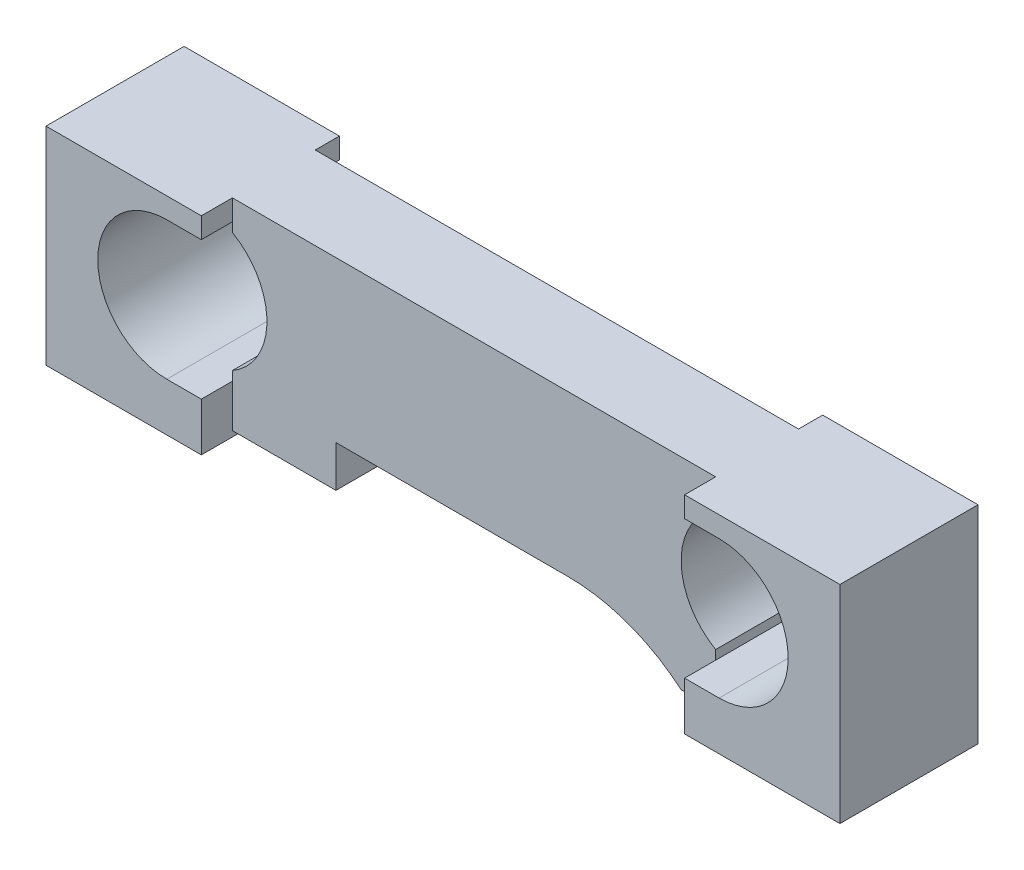
ISO-10303-21;
HEADER;
FILE_DESCRIPTION(('STEP AP214'),'2;1');
FILE_NAME('part.step','',(''),(''),'','','');
FILE_SCHEMA(('AUTOMOTIVE_DESIGN { 1 0 10303 214 1 1 1 1 }'));
ENDSEC;
DATA;
#1=APPLICATION_CONTEXT('core data for automotive mechanical design processes');
#2=APPLICATION_PROTOCOL_DEFINITION('international standard','automotive_design',2000,#1);
#3=PRODUCT_CONTEXT('',#1,'mechanical');
#4=PRODUCT('Part','Part','',(#3));
#5=PRODUCT_RELATED_PRODUCT_CATEGORY('part','',(#4));
#6=PRODUCT_DEFINITION_FORMATION('','',#4);
#7=PRODUCT_DEFINITION_CONTEXT('part definition',#1,'design');
#8=PRODUCT_DEFINITION('design','',#6,#7);
#9=PRODUCT_DEFINITION_SHAPE('','',#8);
#10=(LENGTH_UNIT() NAMED_UNIT(*) SI_UNIT(.MILLI.,.METRE.));
#11=(NAMED_UNIT(*) PLANE_ANGLE_UNIT() SI_UNIT($,.RADIAN.));
#12=(NAMED_UNIT(*) SI_UNIT($,.STERADIAN.) SOLID_ANGLE_UNIT());
#13=UNCERTAINTY_MEASURE_WITH_UNIT(LENGTH_MEASURE(1.E-05),#10,'distance_accuracy_value','');
#14=(GEOMETRIC_REPRESENTATION_CONTEXT(3) GLOBAL_UNCERTAINTY_ASSIGNED_CONTEXT((#13)) GLOBAL_UNIT_ASSIGNED_CONTEXT((#10,
#11,#12)) REPRESENTATION_CONTEXT('',''));
#15=CARTESIAN_POINT('',(0.,0.,0.));
#16=DIRECTION('',(0.,0.,1.));
#17=DIRECTION('',(1.,0.,0.));
#18=AXIS2_PLACEMENT_3D('',#15,#16,#17);
#19=CARTESIAN_POINT('',(234.95,76.2,0.));
#20=DIRECTION('',(1.,0.,0.));
#21=DIRECTION('',(0.,0.,-1.));
#22=AXIS2_PLACEMENT_3D('',#19,#20,#21);
#23=PLANE('',#22);
#24=DIRECTION('',(0.,-1.,0.));
#25=VECTOR('',#24,1.);
#26=CARTESIAN_POINT('',(234.95,76.2,0.));
#27=LINE('',#26,#25);
#28=CARTESIAN_POINT('',(234.95,17.78,0.));
#29=VERTEX_POINT('',#28);
#30=CARTESIAN_POINT('',(234.95,0.,0.));
#31=VERTEX_POINT('',#30);
#32=EDGE_CURVE('E428',#29,#31,#27,.T.);
#33=ORIENTED_EDGE('',*,*,#32,.F.);
#34=DIRECTION('',(0.,0.,1.));
#35=VECTOR('',#34,1.);
#36=CARTESIAN_POINT('',(234.95,17.78,-50.8));
#37=LINE('',#36,#35);
#38=CARTESIAN_POINT('',(234.95,17.78,-11.43));
#39=VERTEX_POINT('',#38);
#40=EDGE_CURVE('E276',#39,#29,#37,.T.);
#41=ORIENTED_EDGE('',*,*,#40,.F.);
#42=DIRECTION('',(0.,-1.,0.));
#43=VECTOR('',#42,1.);
#44=CARTESIAN_POINT('',(234.95,76.2,-11.43));
#45=LINE('',#44,#43);
#46=CARTESIAN_POINT('',(234.95,2.03200000000001,-11.43));
#47=VERTEX_POINT('',#46);
#48=EDGE_CURVE('E432',#39,#47,#45,.T.);
#49=ORIENTED_EDGE('',*,*,#48,.T.);
#50=DIRECTION('',(0.,0.,1.));
#51=VECTOR('',#50,1.);
#52=CARTESIAN_POINT('',(234.95,2.032,-11.43));
#53=LINE('',#52,#51);
#54=CARTESIAN_POINT('',(234.95,2.03200000000001,-41.91));
#55=VERTEX_POINT('',#54);
#56=EDGE_CURVE('E349',#55,#47,#53,.T.);
#57=ORIENTED_EDGE('',*,*,#56,.F.);
#58=DIRECTION('',(0.,-1.,0.));
#59=VECTOR('',#58,1.);
#60=CARTESIAN_POINT('',(234.95,76.2,-41.91));
#61=LINE('',#60,#59);
#62=CARTESIAN_POINT('',(234.95,17.78,-41.91));
#63=VERTEX_POINT('',#62);
#64=EDGE_CURVE('E398',#63,#55,#61,.T.);
#65=ORIENTED_EDGE('',*,*,#64,.F.);
#66=CARTESIAN_POINT('',(234.95,17.78,-50.8));
#67=VERTEX_POINT('',#66);
#68=EDGE_CURVE('E272',#67,#63,#37,.T.);
#69=ORIENTED_EDGE('',*,*,#68,.F.);
#70=DIRECTION('',(0.,-1.,0.));
#71=VECTOR('',#70,1.);
#72=CARTESIAN_POINT('',(234.95,76.2,-50.8));
#73=LINE('',#72,#71);
#74=CARTESIAN_POINT('',(234.95,0.,-50.8));
#75=VERTEX_POINT('',#74);
#76=EDGE_CURVE('E401',#67,#75,#73,.T.);
#77=ORIENTED_EDGE('',*,*,#76,.T.);
#78=DIRECTION('',(0.,0.,1.));
#79=VECTOR('',#78,1.);
#80=CARTESIAN_POINT('',(234.95,0.,0.));
#81=LINE('',#80,#79);
#82=EDGE_CURVE('E409',#75,#31,#81,.T.);
#83=ORIENTED_EDGE('',*,*,#82,.T.);
#84=EDGE_LOOP('',(#33,#41,#49,#57,#65,#69,#77,#83));
#85=FACE_BOUND('',#84,.T.);
#86=ADVANCED_FACE('F34',(#85),#23,.F.);
#87=CARTESIAN_POINT('',(234.95,76.2,-50.8));
#88=VERTEX_POINT('',#87);
#89=CARTESIAN_POINT('',(234.95,68.58,-50.8));
#90=VERTEX_POINT('',#89);
#91=EDGE_CURVE('E399',#88,#90,#73,.T.);
#92=ORIENTED_EDGE('',*,*,#91,.T.);
#93=DIRECTION('',(0.,0.,1.));
#94=VECTOR('',#93,1.);
#95=CARTESIAN_POINT('',(234.95,68.58,-50.8));
#96=LINE('',#95,#94);
#97=CARTESIAN_POINT('',(234.95,68.58,-41.91));
#98=VERTEX_POINT('',#97);
#99=EDGE_CURVE('E57',#90,#98,#96,.T.);
#100=ORIENTED_EDGE('',*,*,#99,.T.);
#101=CARTESIAN_POINT('',(234.95,76.2,-41.91));
#102=VERTEX_POINT('',#101);
#103=EDGE_CURVE('E395',#102,#98,#61,.T.);
#104=ORIENTED_EDGE('',*,*,#103,.F.);
#105=DIRECTION('',(0.,0.,1.));
#106=VECTOR('',#105,1.);
#107=CARTESIAN_POINT('',(234.95,76.2,-50.8));
#108=LINE('',#107,#106);
#109=EDGE_CURVE('E382',#88,#102,#108,.T.);
#110=ORIENTED_EDGE('',*,*,#109,.F.);
#111=EDGE_LOOP('',(#92,#100,#104,#110));
#112=FACE_BOUND('',#111,.T.);
#113=ADVANCED_FACE('F560',(#112),#23,.F.);
#114=CARTESIAN_POINT('',(57.15,76.2,0.));
#115=DIRECTION('',(-1.,0.,0.));
#116=DIRECTION('',(0.,0.,1.));
#117=AXIS2_PLACEMENT_3D('',#114,#115,#116);
#118=PLANE('',#117);
#119=DIRECTION('',(0.,-1.,0.));
#120=VECTOR('',#119,1.);
#121=CARTESIAN_POINT('',(57.15,76.2,-41.91));
#122=LINE('',#121,#120);
#123=CARTESIAN_POINT('',(57.15,76.2,-41.91));
#124=VERTEX_POINT('',#123);
#125=CARTESIAN_POINT('',(57.15,68.58,-41.91));
#126=VERTEX_POINT('',#125);
#127=EDGE_CURVE('E389',#124,#126,#122,.T.);
#128=ORIENTED_EDGE('',*,*,#127,.T.);
#129=DIRECTION('',(0.,0.,1.));
#130=VECTOR('',#129,1.);
#131=CARTESIAN_POINT('',(57.15,68.58,-50.8));
#132=LINE('',#131,#130);
#133=CARTESIAN_POINT('',(57.15,68.58,-50.8));
#134=VERTEX_POINT('',#133);
#135=EDGE_CURVE('E323',#134,#126,#132,.T.);
#136=ORIENTED_EDGE('',*,*,#135,.F.);
#137=DIRECTION('',(0.,-1.,0.));
#138=VECTOR('',#137,1.);
#139=CARTESIAN_POINT('',(57.15,76.2,-50.8));
#140=LINE('',#139,#138);
#141=CARTESIAN_POINT('',(57.15,76.2,-50.8));
#142=VERTEX_POINT('',#141);
#143=EDGE_CURVE('E402',#142,#134,#140,.T.);
#144=ORIENTED_EDGE('',*,*,#143,.F.);
#145=DIRECTION('',(0.,0.,-1.));
#146=VECTOR('',#145,1.);
#147=CARTESIAN_POINT('',(57.15,76.2,-50.8));
#148=LINE('',#147,#146);
#149=EDGE_CURVE('E379',#124,#142,#148,.T.);
#150=ORIENTED_EDGE('',*,*,#149,.F.);
#151=EDGE_LOOP('',(#128,#136,#144,#150));
#152=FACE_BOUND('',#151,.T.);
#153=ADVANCED_FACE('F600',(#152),#118,.F.);
#154=DIRECTION('',(0.,-1.,0.));
#155=VECTOR('',#154,1.);
#156=CARTESIAN_POINT('',(57.15,76.2,0.));
#157=LINE('',#156,#155);
#158=CARTESIAN_POINT('',(57.15,76.2,0.));
#159=VERTEX_POINT('',#158);
#160=CARTESIAN_POINT('',(57.15,68.58,0.));
#161=VERTEX_POINT('',#160);
#162=EDGE_CURVE('E420',#159,#161,#157,.T.);
#163=ORIENTED_EDGE('',*,*,#162,.T.);
#164=DIRECTION('',(0.,0.,-1.));
#165=VECTOR('',#164,1.);
#166=CARTESIAN_POINT('',(57.15,68.58,0.));
#167=LINE('',#166,#165);
#168=CARTESIAN_POINT('',(57.15,68.58,-11.43));
#169=VERTEX_POINT('',#168);
#170=EDGE_CURVE('E11',#161,#169,#167,.T.);
#171=ORIENTED_EDGE('',*,*,#170,.T.);
#172=DIRECTION('',(0.,-1.,0.));
#173=VECTOR('',#172,1.);
#174=CARTESIAN_POINT('',(57.15,76.2,-11.43));
#175=LINE('',#174,#173);
#176=CARTESIAN_POINT('',(57.15,76.2,-11.43));
#177=VERTEX_POINT('',#176);
#178=EDGE_CURVE('E433',#177,#169,#175,.T.);
#179=ORIENTED_EDGE('',*,*,#178,.F.);
#180=DIRECTION('',(0.,0.,-1.));
#181=VECTOR('',#180,1.);
#182=CARTESIAN_POINT('',(57.15,76.2,0.));
#183=LINE('',#182,#181);
#184=EDGE_CURVE('E405',#159,#177,#183,.T.);
#185=ORIENTED_EDGE('',*,*,#184,.F.);
#186=EDGE_LOOP('',(#163,#171,#179,#185));
#187=FACE_BOUND('',#186,.T.);
#188=ADVANCED_FACE('F585',(#187),#118,.F.);
#189=CARTESIAN_POINT('',(234.95,76.2,-11.43));
#190=VERTEX_POINT('',#189);
#191=CARTESIAN_POINT('',(234.95,68.58,-11.43));
#192=VERTEX_POINT('',#191);
#193=EDGE_CURVE('E429',#190,#192,#45,.T.);
#194=ORIENTED_EDGE('',*,*,#193,.T.);
#195=CARTESIAN_POINT('',(234.95,68.58,0.));
#196=VERTEX_POINT('',#195);
#197=EDGE_CURVE('E249',#192,#196,#96,.T.);
#198=ORIENTED_EDGE('',*,*,#197,.T.);
#199=CARTESIAN_POINT('',(234.95,76.2,0.));
#200=VERTEX_POINT('',#199);
#201=EDGE_CURVE('E425',#200,#196,#27,.T.);
#202=ORIENTED_EDGE('',*,*,#201,.F.);
#203=DIRECTION('',(0.,0.,1.));
#204=VECTOR('',#203,1.);
#205=CARTESIAN_POINT('',(234.95,76.2,0.));
#206=LINE('',#205,#204);
#207=EDGE_CURVE('E412',#190,#200,#206,.T.);
#208=ORIENTED_EDGE('',*,*,#207,.F.);
#209=EDGE_LOOP('',(#194,#198,#202,#208));
#210=FACE_BOUND('',#209,.T.);
#211=ADVANCED_FACE('F579',(#210),#23,.F.);
#212=CARTESIAN_POINT('',(0.,17.272,0.));
#213=DIRECTION('',(0.,1.,0.));
#214=DIRECTION('',(0.,0.,1.));
#215=AXIS2_PLACEMENT_3D('',#212,#213,#214);
#216=PLANE('',#215);
#217=DIRECTION('',(1.,0.,0.));
#218=VECTOR('',#217,1.);
#219=CARTESIAN_POINT('',(234.95,17.272,-41.91));
#220=LINE('',#219,#218);
#221=CARTESIAN_POINT('',(95.25,17.272,-41.91));
#222=VERTEX_POINT('',#221);
#223=CARTESIAN_POINT('',(180.513541118106,17.272,-41.91));
#224=VERTEX_POINT('',#223);
#225=EDGE_CURVE('E361',#222,#224,#220,.T.);
#226=ORIENTED_EDGE('',*,*,#225,.T.);
#227=DIRECTION('',(0.,0.,-1.));
#228=VECTOR('',#227,1.);
#229=CARTESIAN_POINT('',(180.513541118106,17.272,0.));
#230=LINE('',#229,#228);
#231=CARTESIAN_POINT('',(180.513541118106,17.272,-11.43));
#232=VERTEX_POINT('',#231);
#233=EDGE_CURVE('E474',#224,#232,#230,.F.);
#234=ORIENTED_EDGE('',*,*,#233,.T.);
#235=DIRECTION('',(-1.,0.,0.));
#236=VECTOR('',#235,1.);
#237=CARTESIAN_POINT('',(234.95,17.272,-11.43));
#238=LINE('',#237,#236);
#239=CARTESIAN_POINT('',(95.25,17.272,-11.43));
#240=VERTEX_POINT('',#239);
#241=EDGE_CURVE('E356',#232,#240,#238,.T.);
#242=ORIENTED_EDGE('',*,*,#241,.T.);
#243=DIRECTION('',(0.,0.,-1.));
#244=VECTOR('',#243,1.);
#245=CARTESIAN_POINT('',(95.25,17.272,-11.43));
#246=LINE('',#245,#244);
#247=EDGE_CURVE('E358',#240,#222,#246,.T.);
#248=ORIENTED_EDGE('',*,*,#247,.T.);
#249=EDGE_LOOP('',(#226,#234,#242,#248));
#250=FACE_BOUND('',#249,.T.);
#251=ADVANCED_FACE('F525',(#250),#216,.F.);
#252=CARTESIAN_POINT('',(0.,0.,0.));
#253=DIRECTION('',(0.,-1.,0.));
#254=DIRECTION('',(0.,0.,-1.));
#255=AXIS2_PLACEMENT_3D('',#252,#253,#254);
#256=PLANE('',#255);
#257=DIRECTION('',(-1.,0.,0.));
#258=VECTOR('',#257,1.);
#259=CARTESIAN_POINT('',(0.,0.,-50.8));
#260=LINE('',#259,#258);
#261=CARTESIAN_POINT('',(57.15,0.,-50.8));
#262=VERTEX_POINT('',#261);
#263=CARTESIAN_POINT('',(0.,0.,-50.8));
#264=VERTEX_POINT('',#263);
#265=EDGE_CURVE('E460',#262,#264,#260,.T.);
#266=ORIENTED_EDGE('',*,*,#265,.F.);
#267=DIRECTION('',(0.,0.,-1.));
#268=VECTOR('',#267,1.);
#269=CARTESIAN_POINT('',(57.15,0.,0.));
#270=LINE('',#269,#268);
#271=CARTESIAN_POINT('',(57.15,0.,0.));
#272=VERTEX_POINT('',#271);
#273=EDGE_CURVE('E392',#272,#262,#270,.T.);
#274=ORIENTED_EDGE('',*,*,#273,.F.);
#275=DIRECTION('',(1.,0.,0.));
#276=VECTOR('',#275,1.);
#277=CARTESIAN_POINT('',(0.,0.,0.));
#278=LINE('',#277,#276);
#279=CARTESIAN_POINT('',(0.,0.,0.));
#280=VERTEX_POINT('',#279);
#281=EDGE_CURVE('E455',#280,#272,#278,.T.);
#282=ORIENTED_EDGE('',*,*,#281,.F.);
#283=DIRECTION('',(0.,0.,1.));
#284=VECTOR('',#283,1.);
#285=CARTESIAN_POINT('',(0.,0.,0.));
#286=LINE('',#285,#284);
#287=EDGE_CURVE('E423',#264,#280,#286,.T.);
#288=ORIENTED_EDGE('',*,*,#287,.F.);
#289=EDGE_LOOP('',(#266,#274,#282,#288));
#290=FACE_BOUND('',#289,.T.);
#291=ADVANCED_FACE('F498',(#290),#256,.T.);
#292=CARTESIAN_POINT('',(57.15,76.2,-11.43));
#293=DIRECTION('',(0.,0.,-1.));
#294=DIRECTION('',(-1.,0.,0.));
#295=AXIS2_PLACEMENT_3D('',#292,#293,#294);
#296=PLANE('',#295);
#297=DIRECTION('',(0.,1.,0.));
#298=VECTOR('',#297,1.);
#299=CARTESIAN_POINT('',(234.95,76.2,-11.43));
#300=LINE('',#299,#298);
#301=CARTESIAN_POINT('',(234.95,21.1829547438753,-11.43));
#302=VERTEX_POINT('',#301);
#303=EDGE_CURVE('E299',#39,#302,#300,.T.);
#304=ORIENTED_EDGE('',*,*,#303,.T.);
#305=CARTESIAN_POINT('',(247.65,43.18,-11.43));
#306=DIRECTION('',(0.,0.,-1.));
#307=DIRECTION('',(-1.,0.,0.));
#308=AXIS2_PLACEMENT_3D('',#305,#306,#307);
#309=CIRCLE('',#308,25.4);
#310=CARTESIAN_POINT('',(234.95,65.1770452561247,-11.43));
#311=VERTEX_POINT('',#310);
#312=EDGE_CURVE('E293',#302,#311,#309,.T.);
#313=ORIENTED_EDGE('',*,*,#312,.T.);
#314=DIRECTION('',(0.,1.,0.));
#315=VECTOR('',#314,1.);
#316=CARTESIAN_POINT('',(234.95,76.2,-11.43));
#317=LINE('',#316,#315);
#318=EDGE_CURVE('E287',#311,#192,#317,.T.);
#319=ORIENTED_EDGE('',*,*,#318,.T.);
#320=ORIENTED_EDGE('',*,*,#193,.F.);
#321=DIRECTION('',(1.,0.,0.));
#322=VECTOR('',#321,1.);
#323=CARTESIAN_POINT('',(57.15,76.2,-11.43));
#324=LINE('',#323,#322);
#325=EDGE_CURVE('E408',#177,#190,#324,.T.);
#326=ORIENTED_EDGE('',*,*,#325,.F.);
#327=ORIENTED_EDGE('',*,*,#178,.T.);
#328=CARTESIAN_POINT('',(57.15,65.1770452561247,-11.43));
#329=VERTEX_POINT('',#328);
#330=EDGE_CURVE('E436',#169,#329,#175,.T.);
#331=ORIENTED_EDGE('',*,*,#330,.T.);
#332=CARTESIAN_POINT('',(44.45,43.18,-11.43));
#333=DIRECTION('',(0.,0.,-1.));
#334=DIRECTION('',(-1.,0.,0.));
#335=AXIS2_PLACEMENT_3D('',#332,#333,#334);
#336=CIRCLE('',#335,25.4);
#337=CARTESIAN_POINT('',(57.15,21.1829547438752,-11.43));
#338=VERTEX_POINT('',#337);
#339=EDGE_CURVE('E340',#329,#338,#336,.T.);
#340=ORIENTED_EDGE('',*,*,#339,.T.);
#341=CARTESIAN_POINT('',(57.15,17.78,-11.43));
#342=VERTEX_POINT('',#341);
#343=EDGE_CURVE('E595',#338,#342,#175,.T.);
#344=ORIENTED_EDGE('',*,*,#343,.T.);
#345=CARTESIAN_POINT('',(57.15,2.032,-11.43));
#346=VERTEX_POINT('',#345);
#347=EDGE_CURVE('E415',#342,#346,#175,.T.);
#348=ORIENTED_EDGE('',*,*,#347,.T.);
#349=DIRECTION('',(-1.,0.,0.));
#350=VECTOR('',#349,1.);
#351=CARTESIAN_POINT('',(57.15,2.032,-11.43));
#352=LINE('',#351,#350);
#353=CARTESIAN_POINT('',(95.25,2.032,-11.43));
#354=VERTEX_POINT('',#353);
#355=EDGE_CURVE('E376',#354,#346,#352,.T.);
#356=ORIENTED_EDGE('',*,*,#355,.F.);
#357=DIRECTION('',(0.,-1.,0.));
#358=VECTOR('',#357,1.);
#359=CARTESIAN_POINT('',(95.25,17.272,-11.43));
#360=LINE('',#359,#358);
#361=EDGE_CURVE('E364',#240,#354,#360,.T.);
#362=ORIENTED_EDGE('',*,*,#361,.F.);
#363=ORIENTED_EDGE('',*,*,#241,.F.);
#364=CARTESIAN_POINT('',(180.513541118106,-47.498,-11.43));
#365=DIRECTION('',(0.,0.,-1.));
#366=DIRECTION('',(-1.,0.,0.));
#367=AXIS2_PLACEMENT_3D('',#364,#365,#366);
#368=CIRCLE('',#367,64.77);
#369=CARTESIAN_POINT('',(222.25,2.032,-11.43));
#370=VERTEX_POINT('',#369);
#371=EDGE_CURVE('E478',#232,#370,#368,.T.);
#372=ORIENTED_EDGE('',*,*,#371,.T.);
#373=DIRECTION('',(-1.,0.,0.));
#374=VECTOR('',#373,1.);
#375=CARTESIAN_POINT('',(222.25,2.032,-11.43));
#376=LINE('',#375,#374);
#377=EDGE_CURVE('E352',#47,#370,#376,.T.);
#378=ORIENTED_EDGE('',*,*,#377,.F.);
#379=ORIENTED_EDGE('',*,*,#48,.F.);
#380=EDGE_LOOP('',(#304,#313,#319,#320,#326,#327,#331,#340,#344,#348,#356,#362,#363,#372,#378,#379));
#381=FACE_BOUND('',#380,.T.);
#382=ADVANCED_FACE('F530',(#381),#296,.F.);
#383=CARTESIAN_POINT('',(57.15,76.2,-41.91));
#384=DIRECTION('',(0.,0.,1.));
#385=DIRECTION('',(1.,0.,0.));
#386=AXIS2_PLACEMENT_3D('',#383,#384,#385);
#387=PLANE('',#386);
#388=DIRECTION('',(0.,-1.,0.));
#389=VECTOR('',#388,1.);
#390=CARTESIAN_POINT('',(234.95,76.2,-41.91));
#391=LINE('',#390,#389);
#392=CARTESIAN_POINT('',(234.95,65.1770452561247,-41.91));
#393=VERTEX_POINT('',#392);
#394=EDGE_CURVE('E271',#98,#393,#391,.T.);
#395=ORIENTED_EDGE('',*,*,#394,.T.);
#396=CARTESIAN_POINT('',(247.65,43.18,-41.91));
#397=DIRECTION('',(0.,0.,1.));
#398=DIRECTION('',(1.,0.,0.));
#399=AXIS2_PLACEMENT_3D('',#396,#397,#398);
#400=CIRCLE('',#399,25.4);
#401=CARTESIAN_POINT('',(234.95,21.1829547438753,-41.91));
#402=VERTEX_POINT('',#401);
#403=EDGE_CURVE('E290',#393,#402,#400,.T.);
#404=ORIENTED_EDGE('',*,*,#403,.T.);
#405=DIRECTION('',(0.,-1.,0.));
#406=VECTOR('',#405,1.);
#407=CARTESIAN_POINT('',(234.95,76.2,-41.91));
#408=LINE('',#407,#406);
#409=EDGE_CURVE('E296',#402,#63,#408,.T.);
#410=ORIENTED_EDGE('',*,*,#409,.T.);
#411=ORIENTED_EDGE('',*,*,#64,.T.);
#412=DIRECTION('',(1.,0.,0.));
#413=VECTOR('',#412,1.);
#414=CARTESIAN_POINT('',(222.25,2.032,-41.91));
#415=LINE('',#414,#413);
#416=CARTESIAN_POINT('',(222.25,2.032,-41.91));
#417=VERTEX_POINT('',#416);
#418=EDGE_CURVE('E346',#417,#55,#415,.T.);
#419=ORIENTED_EDGE('',*,*,#418,.F.);
#420=CARTESIAN_POINT('',(180.513541118106,-47.498,-41.91));
#421=DIRECTION('',(0.,0.,1.));
#422=DIRECTION('',(1.,0.,0.));
#423=AXIS2_PLACEMENT_3D('',#420,#421,#422);
#424=CIRCLE('',#423,64.77);
#425=EDGE_CURVE('E476',#417,#224,#424,.T.);
#426=ORIENTED_EDGE('',*,*,#425,.T.);
#427=ORIENTED_EDGE('',*,*,#225,.F.);
#428=DIRECTION('',(0.,-1.,0.));
#429=VECTOR('',#428,1.);
#430=CARTESIAN_POINT('',(95.25,17.272,-41.91));
#431=LINE('',#430,#429);
#432=CARTESIAN_POINT('',(95.25,2.032,-41.91));
#433=VERTEX_POINT('',#432);
#434=EDGE_CURVE('E366',#222,#433,#431,.T.);
#435=ORIENTED_EDGE('',*,*,#434,.T.);
#436=DIRECTION('',(1.,0.,0.));
#437=VECTOR('',#436,1.);
#438=CARTESIAN_POINT('',(57.15,2.032,-41.91));
#439=LINE('',#438,#437);
#440=CARTESIAN_POINT('',(57.15,2.032,-41.91));
#441=VERTEX_POINT('',#440);
#442=EDGE_CURVE('E373',#441,#433,#439,.T.);
#443=ORIENTED_EDGE('',*,*,#442,.F.);
#444=CARTESIAN_POINT('',(57.15,17.78,-41.91));
#445=VERTEX_POINT('',#444);
#446=EDGE_CURVE('E394',#445,#441,#122,.T.);
#447=ORIENTED_EDGE('',*,*,#446,.F.);
#448=CARTESIAN_POINT('',(57.15,21.1829547438752,-41.91));
#449=VERTEX_POINT('',#448);
#450=EDGE_CURVE('E510',#449,#445,#122,.T.);
#451=ORIENTED_EDGE('',*,*,#450,.F.);
#452=CARTESIAN_POINT('',(44.45,43.18,-41.91));
#453=DIRECTION('',(0.,0.,1.));
#454=DIRECTION('',(1.,0.,0.));
#455=AXIS2_PLACEMENT_3D('',#452,#453,#454);
#456=CIRCLE('',#455,25.4);
#457=CARTESIAN_POINT('',(57.15,65.1770452561247,-41.91));
#458=VERTEX_POINT('',#457);
#459=EDGE_CURVE('E322',#449,#458,#456,.T.);
#460=ORIENTED_EDGE('',*,*,#459,.T.);
#461=EDGE_CURVE('E393',#126,#458,#122,.T.);
#462=ORIENTED_EDGE('',*,*,#461,.F.);
#463=ORIENTED_EDGE('',*,*,#127,.F.);
#464=DIRECTION('',(-1.,0.,0.));
#465=VECTOR('',#464,1.);
#466=CARTESIAN_POINT('',(57.15,76.2,-41.91));
#467=LINE('',#466,#465);
#468=EDGE_CURVE('E385',#102,#124,#467,.T.);
#469=ORIENTED_EDGE('',*,*,#468,.F.);
#470=ORIENTED_EDGE('',*,*,#103,.T.);
#471=EDGE_LOOP('',(#395,#404,#410,#411,#419,#426,#427,#435,#443,#447,#451,#460,#462,#463,#469,#470));
#472=FACE_BOUND('',#471,.T.);
#473=ADVANCED_FACE('F518',(#472),#387,.F.);
#474=CARTESIAN_POINT('',(0.,76.2,-50.8));
#475=DIRECTION('',(0.,0.,1.));
#476=DIRECTION('',(1.,0.,0.));
#477=AXIS2_PLACEMENT_3D('',#474,#475,#476);
#478=PLANE('',#477);
#479=ORIENTED_EDGE('',*,*,#143,.T.);
#480=DIRECTION('',(-1.,0.,0.));
#481=VECTOR('',#480,1.);
#482=CARTESIAN_POINT('',(44.4499999999999,68.58,-50.8));
#483=LINE('',#482,#481);
#484=CARTESIAN_POINT('',(44.4499999999999,68.58,-50.8));
#485=VERTEX_POINT('',#484);
#486=EDGE_CURVE('E310',#134,#485,#483,.T.);
#487=ORIENTED_EDGE('',*,*,#486,.T.);
#488=CARTESIAN_POINT('',(44.45,43.18,-50.8));
#489=DIRECTION('',(0.,0.,1.));
#490=DIRECTION('',(1.,0.,0.));
#491=AXIS2_PLACEMENT_3D('',#488,#489,#490);
#492=CIRCLE('',#491,25.4);
#493=CARTESIAN_POINT('',(44.45,17.78,-50.8));
#494=VERTEX_POINT('',#493);
#495=EDGE_CURVE('E303',#485,#494,#492,.T.);
#496=ORIENTED_EDGE('',*,*,#495,.T.);
#497=DIRECTION('',(1.,0.,0.));
#498=VECTOR('',#497,1.);
#499=CARTESIAN_POINT('',(44.45,17.78,-50.8));
#500=LINE('',#499,#498);
#501=CARTESIAN_POINT('',(57.15,17.78,-50.8));
#502=VERTEX_POINT('',#501);
#503=EDGE_CURVE('E306',#494,#502,#500,.T.);
#504=ORIENTED_EDGE('',*,*,#503,.T.);
#505=EDGE_CURVE('E388',#502,#262,#140,.T.);
#506=ORIENTED_EDGE('',*,*,#505,.T.);
#507=ORIENTED_EDGE('',*,*,#265,.T.);
#508=DIRECTION('',(0.,-1.,0.));
#509=VECTOR('',#508,1.);
#510=CARTESIAN_POINT('',(0.,76.2,-50.8));
#511=LINE('',#510,#509);
#512=CARTESIAN_POINT('',(0.,76.2,-50.8));
#513=VERTEX_POINT('',#512);
#514=EDGE_CURVE('E451',#513,#264,#511,.T.);
#515=ORIENTED_EDGE('',*,*,#514,.F.);
#516=DIRECTION('',(-1.,0.,0.));
#517=VECTOR('',#516,1.);
#518=CARTESIAN_POINT('',(0.,76.2,-50.8));
#519=LINE('',#518,#517);
#520=EDGE_CURVE('E447',#142,#513,#519,.T.);
#521=ORIENTED_EDGE('',*,*,#520,.F.);
#522=EDGE_LOOP('',(#479,#487,#496,#504,#506,#507,#515,#521));
#523=FACE_BOUND('',#522,.T.);
#524=ADVANCED_FACE('F501',(#523),#478,.F.);
#525=CARTESIAN_POINT('',(0.,76.2,0.));
#526=DIRECTION('',(0.,0.,-1.));
#527=DIRECTION('',(-1.,0.,0.));
#528=AXIS2_PLACEMENT_3D('',#525,#526,#527);
#529=PLANE('',#528);
#530=CARTESIAN_POINT('',(44.45,43.18,0.));
#531=DIRECTION('',(0.,0.,1.));
#532=DIRECTION('',(1.,0.,0.));
#533=AXIS2_PLACEMENT_3D('',#530,#531,#532);
#534=CIRCLE('',#533,25.4);
#535=CARTESIAN_POINT('',(44.4499999999999,68.58,0.));
#536=VERTEX_POINT('',#535);
#537=CARTESIAN_POINT('',(44.45,17.78,0.));
#538=VERTEX_POINT('',#537);
#539=EDGE_CURVE('E302',#536,#538,#534,.T.);
#540=ORIENTED_EDGE('',*,*,#539,.F.);
#541=DIRECTION('',(-1.,0.,0.));
#542=VECTOR('',#541,1.);
#543=CARTESIAN_POINT('',(44.4499999999999,68.58,0.));
#544=LINE('',#543,#542);
#545=EDGE_CURVE('E307',#161,#536,#544,.T.);
#546=ORIENTED_EDGE('',*,*,#545,.F.);
#547=ORIENTED_EDGE('',*,*,#162,.F.);
#548=DIRECTION('',(1.,0.,0.));
#549=VECTOR('',#548,1.);
#550=CARTESIAN_POINT('',(0.,76.2,0.));
#551=LINE('',#550,#549);
#552=CARTESIAN_POINT('',(0.,76.2,0.));
#553=VERTEX_POINT('',#552);
#554=EDGE_CURVE('E442',#553,#159,#551,.T.);
#555=ORIENTED_EDGE('',*,*,#554,.F.);
#556=DIRECTION('',(0.,-1.,0.));
#557=VECTOR('',#556,1.);
#558=CARTESIAN_POINT('',(0.,76.2,0.));
#559=LINE('',#558,#557);
#560=EDGE_CURVE('E471',#553,#280,#559,.T.);
#561=ORIENTED_EDGE('',*,*,#560,.T.);
#562=ORIENTED_EDGE('',*,*,#281,.T.);
#563=CARTESIAN_POINT('',(57.15,17.78,0.));
#564=VERTEX_POINT('',#563);
#565=EDGE_CURVE('E424',#564,#272,#157,.T.);
#566=ORIENTED_EDGE('',*,*,#565,.F.);
#567=DIRECTION('',(1.,0.,0.));
#568=VECTOR('',#567,1.);
#569=CARTESIAN_POINT('',(44.45,17.78,0.));
#570=LINE('',#569,#568);
#571=EDGE_CURVE('E316',#538,#564,#570,.T.);
#572=ORIENTED_EDGE('',*,*,#571,.F.);
#573=EDGE_LOOP('',(#540,#546,#547,#555,#561,#562,#566,#572));
#574=FACE_BOUND('',#573,.T.);
#575=ADVANCED_FACE('F493',(#574),#529,.F.);
#576=CARTESIAN_POINT('',(0.,76.2,0.));
#577=DIRECTION('',(1.,0.,0.));
#578=DIRECTION('',(0.,0.,-1.));
#579=AXIS2_PLACEMENT_3D('',#576,#577,#578);
#580=PLANE('',#579);
#581=ORIENTED_EDGE('',*,*,#287,.T.);
#582=ORIENTED_EDGE('',*,*,#560,.F.);
#583=DIRECTION('',(0.,0.,1.));
#584=VECTOR('',#583,1.);
#585=CARTESIAN_POINT('',(0.,76.2,0.));
#586=LINE('',#585,#584);
#587=EDGE_CURVE('E437',#513,#553,#586,.T.);
#588=ORIENTED_EDGE('',*,*,#587,.F.);
#589=ORIENTED_EDGE('',*,*,#514,.T.);
#590=EDGE_LOOP('',(#581,#582,#588,#589));
#591=FACE_BOUND('',#590,.T.);
#592=ADVANCED_FACE('F604',(#591),#580,.F.);
#593=CARTESIAN_POINT('',(247.65,43.18,0.));
#594=DIRECTION('',(0.,0.,1.));
#595=DIRECTION('',(1.,0.,0.));
#596=AXIS2_PLACEMENT_3D('',#593,#594,#595);
#597=CIRCLE('',#596,25.4);
#598=CARTESIAN_POINT('',(247.65,17.78,0.));
#599=VERTEX_POINT('',#598);
#600=CARTESIAN_POINT('',(247.65,68.58,0.));
#601=VERTEX_POINT('',#600);
#602=EDGE_CURVE('E49',#599,#601,#597,.T.);
#603=ORIENTED_EDGE('',*,*,#602,.F.);
#604=DIRECTION('',(1.,0.,0.));
#605=VECTOR('',#604,1.);
#606=CARTESIAN_POINT('',(247.65,17.78,0.));
#607=LINE('',#606,#605);
#608=EDGE_CURVE('E260',#29,#599,#607,.T.);
#609=ORIENTED_EDGE('',*,*,#608,.F.);
#610=ORIENTED_EDGE('',*,*,#32,.T.);
#611=CARTESIAN_POINT('',(292.1,0.,0.));
#612=VERTEX_POINT('',#611);
#613=EDGE_CURVE('E454',#31,#612,#278,.T.);
#614=ORIENTED_EDGE('',*,*,#613,.T.);
#615=DIRECTION('',(0.,-1.,0.));
#616=VECTOR('',#615,1.);
#617=CARTESIAN_POINT('',(292.1,76.2,0.));
#618=LINE('',#617,#616);
#619=CARTESIAN_POINT('',(292.1,76.2,0.));
#620=VERTEX_POINT('',#619);
#621=EDGE_CURVE('E468',#620,#612,#618,.T.);
#622=ORIENTED_EDGE('',*,*,#621,.F.);
#623=EDGE_CURVE('E440',#200,#620,#551,.T.);
#624=ORIENTED_EDGE('',*,*,#623,.F.);
#625=ORIENTED_EDGE('',*,*,#201,.T.);
#626=DIRECTION('',(-1.,0.,0.));
#627=VECTOR('',#626,1.);
#628=CARTESIAN_POINT('',(247.65,68.58,0.));
#629=LINE('',#628,#627);
#630=EDGE_CURVE('E263',#601,#196,#629,.T.);
#631=ORIENTED_EDGE('',*,*,#630,.F.);
#632=EDGE_LOOP('',(#603,#609,#610,#614,#622,#624,#625,#631));
#633=FACE_BOUND('',#632,.T.);
#634=ADVANCED_FACE('F577',(#633),#529,.F.);
#635=CARTESIAN_POINT('',(292.1,76.2,0.));
#636=DIRECTION('',(-1.,0.,0.));
#637=DIRECTION('',(0.,0.,1.));
#638=AXIS2_PLACEMENT_3D('',#635,#636,#637);
#639=PLANE('',#638);
#640=DIRECTION('',(0.,0.,-1.));
#641=VECTOR('',#640,1.);
#642=CARTESIAN_POINT('',(292.1,0.,0.));
#643=LINE('',#642,#641);
#644=CARTESIAN_POINT('',(292.1,0.,-50.8));
#645=VERTEX_POINT('',#644);
#646=EDGE_CURVE('E458',#612,#645,#643,.T.);
#647=ORIENTED_EDGE('',*,*,#646,.T.);
#648=DIRECTION('',(0.,-1.,0.));
#649=VECTOR('',#648,1.);
#650=CARTESIAN_POINT('',(292.1,76.2,-50.8));
#651=LINE('',#650,#649);
#652=CARTESIAN_POINT('',(292.1,76.2,-50.8));
#653=VERTEX_POINT('',#652);
#654=EDGE_CURVE('E465',#653,#645,#651,.T.);
#655=ORIENTED_EDGE('',*,*,#654,.F.);
#656=DIRECTION('',(0.,0.,-1.));
#657=VECTOR('',#656,1.);
#658=CARTESIAN_POINT('',(292.1,76.2,0.));
#659=LINE('',#658,#657);
#660=EDGE_CURVE('E445',#620,#653,#659,.T.);
#661=ORIENTED_EDGE('',*,*,#660,.F.);
#662=ORIENTED_EDGE('',*,*,#621,.T.);
#663=EDGE_LOOP('',(#647,#655,#661,#662));
#664=FACE_BOUND('',#663,.T.);
#665=ADVANCED_FACE('F569',(#664),#639,.F.);
#666=ORIENTED_EDGE('',*,*,#76,.F.);
#667=DIRECTION('',(1.,0.,0.));
#668=VECTOR('',#667,1.);
#669=CARTESIAN_POINT('',(247.65,17.78,-50.8));
#670=LINE('',#669,#668);
#671=CARTESIAN_POINT('',(247.65,17.78,-50.8));
#672=VERTEX_POINT('',#671);
#673=EDGE_CURVE('E250',#67,#672,#670,.T.);
#674=ORIENTED_EDGE('',*,*,#673,.T.);
#675=CARTESIAN_POINT('',(247.65,43.18,-50.8));
#676=DIRECTION('',(0.,0.,1.));
#677=DIRECTION('',(1.,0.,0.));
#678=AXIS2_PLACEMENT_3D('',#675,#676,#677);
#679=CIRCLE('',#678,25.4);
#680=CARTESIAN_POINT('',(247.65,68.58,-50.8));
#681=VERTEX_POINT('',#680);
#682=EDGE_CURVE('E246',#672,#681,#679,.T.);
#683=ORIENTED_EDGE('',*,*,#682,.T.);
#684=DIRECTION('',(-1.,0.,0.));
#685=VECTOR('',#684,1.);
#686=CARTESIAN_POINT('',(247.65,68.58,-50.8));
#687=LINE('',#686,#685);
#688=EDGE_CURVE('E252',#681,#90,#687,.T.);
#689=ORIENTED_EDGE('',*,*,#688,.T.);
#690=ORIENTED_EDGE('',*,*,#91,.F.);
#691=EDGE_CURVE('E448',#653,#88,#519,.T.);
#692=ORIENTED_EDGE('',*,*,#691,.F.);
#693=ORIENTED_EDGE('',*,*,#654,.T.);
#694=EDGE_CURVE('E441',#645,#75,#260,.T.);
#695=ORIENTED_EDGE('',*,*,#694,.T.);
#696=EDGE_LOOP('',(#666,#674,#683,#689,#690,#692,#693,#695));
#697=FACE_BOUND('',#696,.T.);
#698=ADVANCED_FACE('F259',(#697),#478,.F.);
#699=CARTESIAN_POINT('',(0.,76.2,0.));
#700=DIRECTION('',(0.,-1.,0.));
#701=DIRECTION('',(0.,0.,-1.));
#702=AXIS2_PLACEMENT_3D('',#699,#700,#701);
#703=PLANE('',#702);
#704=ORIENTED_EDGE('',*,*,#468,.T.);
#705=ORIENTED_EDGE('',*,*,#149,.T.);
#706=ORIENTED_EDGE('',*,*,#520,.T.);
#707=ORIENTED_EDGE('',*,*,#587,.T.);
#708=ORIENTED_EDGE('',*,*,#554,.T.);
#709=ORIENTED_EDGE('',*,*,#184,.T.);
#710=ORIENTED_EDGE('',*,*,#325,.T.);
#711=ORIENTED_EDGE('',*,*,#207,.T.);
#712=ORIENTED_EDGE('',*,*,#623,.T.);
#713=ORIENTED_EDGE('',*,*,#660,.T.);
#714=ORIENTED_EDGE('',*,*,#691,.T.);
#715=ORIENTED_EDGE('',*,*,#109,.T.);
#716=EDGE_LOOP('',(#704,#705,#706,#707,#708,#709,#710,#711,#712,#713,#714,#715));
#717=FACE_BOUND('',#716,.T.);
#718=ADVANCED_FACE('F563',(#717),#703,.F.);
#719=ORIENTED_EDGE('',*,*,#82,.F.);
#720=ORIENTED_EDGE('',*,*,#694,.F.);
#721=ORIENTED_EDGE('',*,*,#646,.F.);
#722=ORIENTED_EDGE('',*,*,#613,.F.);
#723=EDGE_LOOP('',(#719,#720,#721,#722));
#724=FACE_BOUND('',#723,.T.);
#725=ADVANCED_FACE('F574',(#724),#256,.T.);
#726=ORIENTED_EDGE('',*,*,#505,.F.);
#727=DIRECTION('',(0.,0.,1.));
#728=VECTOR('',#727,1.);
#729=CARTESIAN_POINT('',(57.15,17.78,-50.8));
#730=LINE('',#729,#728);
#731=EDGE_CURVE('E333',#502,#445,#730,.T.);
#732=ORIENTED_EDGE('',*,*,#731,.T.);
#733=ORIENTED_EDGE('',*,*,#446,.T.);
#734=DIRECTION('',(0.,0.,-1.));
#735=VECTOR('',#734,1.);
#736=CARTESIAN_POINT('',(57.15,2.032,-11.43));
#737=LINE('',#736,#735);
#738=EDGE_CURVE('E369',#346,#441,#737,.T.);
#739=ORIENTED_EDGE('',*,*,#738,.F.);
#740=ORIENTED_EDGE('',*,*,#347,.F.);
#741=DIRECTION('',(0.,0.,1.));
#742=VECTOR('',#741,1.);
#743=CARTESIAN_POINT('',(57.15,17.78,0.));
#744=LINE('',#743,#742);
#745=EDGE_CURVE('E42',#342,#564,#744,.T.);
#746=ORIENTED_EDGE('',*,*,#745,.T.);
#747=ORIENTED_EDGE('',*,*,#565,.T.);
#748=ORIENTED_EDGE('',*,*,#273,.T.);
#749=EDGE_LOOP('',(#726,#732,#733,#739,#740,#746,#747,#748));
#750=FACE_BOUND('',#749,.T.);
#751=ADVANCED_FACE('F484',(#750),#118,.F.);
#752=CARTESIAN_POINT('',(0.,2.032,0.));
#753=DIRECTION('',(0.,-1.,0.));
#754=DIRECTION('',(0.,0.,-1.));
#755=AXIS2_PLACEMENT_3D('',#752,#753,#754);
#756=PLANE('',#755);
#757=DIRECTION('',(0.,0.,-1.));
#758=VECTOR('',#757,1.);
#759=CARTESIAN_POINT('',(95.25,2.032,-11.43));
#760=LINE('',#759,#758);
#761=EDGE_CURVE('E355',#354,#433,#760,.T.);
#762=ORIENTED_EDGE('',*,*,#761,.F.);
#763=ORIENTED_EDGE('',*,*,#355,.T.);
#764=ORIENTED_EDGE('',*,*,#738,.T.);
#765=ORIENTED_EDGE('',*,*,#442,.T.);
#766=EDGE_LOOP('',(#762,#763,#764,#765));
#767=FACE_BOUND('',#766,.T.);
#768=ADVANCED_FACE('F516',(#767),#756,.T.);
#769=CARTESIAN_POINT('',(95.25,17.272,-11.43));
#770=DIRECTION('',(-1.,0.,0.));
#771=DIRECTION('',(0.,0.,1.));
#772=AXIS2_PLACEMENT_3D('',#769,#770,#771);
#773=PLANE('',#772);
#774=ORIENTED_EDGE('',*,*,#761,.T.);
#775=ORIENTED_EDGE('',*,*,#434,.F.);
#776=ORIENTED_EDGE('',*,*,#247,.F.);
#777=ORIENTED_EDGE('',*,*,#361,.T.);
#778=EDGE_LOOP('',(#774,#775,#776,#777));
#779=FACE_BOUND('',#778,.T.);
#780=ADVANCED_FACE('F522',(#779),#773,.F.);
#781=CARTESIAN_POINT('',(0.,2.032,0.));
#782=DIRECTION('',(0.,-1.,0.));
#783=DIRECTION('',(0.,0.,-1.));
#784=AXIS2_PLACEMENT_3D('',#781,#782,#783);
#785=PLANE('',#784);
#786=DIRECTION('',(0.,0.,-1.));
#787=VECTOR('',#786,1.);
#788=CARTESIAN_POINT('',(222.25,2.032,-11.43));
#789=LINE('',#788,#787);
#790=EDGE_CURVE('E343',#370,#417,#789,.T.);
#791=ORIENTED_EDGE('',*,*,#790,.T.);
#792=ORIENTED_EDGE('',*,*,#418,.T.);
#793=ORIENTED_EDGE('',*,*,#56,.T.);
#794=ORIENTED_EDGE('',*,*,#377,.T.);
#795=EDGE_LOOP('',(#791,#792,#793,#794));
#796=FACE_BOUND('',#795,.T.);
#797=ADVANCED_FACE('F536',(#796),#785,.T.);
#798=CARTESIAN_POINT('',(180.513541118106,-47.498,-11.43));
#799=DIRECTION('',(0.,0.,-1.));
#800=DIRECTION('',(-1.,0.,0.));
#801=AXIS2_PLACEMENT_3D('',#798,#799,#800);
#802=CYLINDRICAL_SURFACE('',#801,64.77);
#803=ORIENTED_EDGE('',*,*,#371,.F.);
#804=ORIENTED_EDGE('',*,*,#233,.F.);
#805=ORIENTED_EDGE('',*,*,#425,.F.);
#806=ORIENTED_EDGE('',*,*,#790,.F.);
#807=EDGE_LOOP('',(#803,#804,#805,#806));
#808=FACE_BOUND('',#807,.T.);
#809=ADVANCED_FACE('F36',(#808),#802,.F.);
#810=CARTESIAN_POINT('',(57.15,68.58,-50.8));
#811=DIRECTION('',(1.,0.,0.));
#812=DIRECTION('',(0.,0.,-1.));
#813=AXIS2_PLACEMENT_3D('',#810,#811,#812);
#814=PLANE('',#813);
#815=EDGE_CURVE('E326',#126,#169,#132,.T.);
#816=ORIENTED_EDGE('',*,*,#815,.F.);
#817=ORIENTED_EDGE('',*,*,#461,.T.);
#818=DIRECTION('',(0.,0.,1.));
#819=VECTOR('',#818,1.);
#820=CARTESIAN_POINT('',(57.15,65.1770452561247,-50.8));
#821=LINE('',#820,#819);
#822=EDGE_CURVE('E327',#458,#329,#821,.T.);
#823=ORIENTED_EDGE('',*,*,#822,.T.);
#824=ORIENTED_EDGE('',*,*,#330,.F.);
#825=EDGE_LOOP('',(#816,#817,#823,#824));
#826=FACE_BOUND('',#825,.T.);
#827=ADVANCED_FACE('F593',(#826),#814,.F.);
#828=CARTESIAN_POINT('',(57.15,17.78,-50.8));
#829=DIRECTION('',(1.,0.,0.));
#830=DIRECTION('',(0.,1.,0.));
#831=AXIS2_PLACEMENT_3D('',#828,#829,#830);
#832=PLANE('',#831);
#833=DIRECTION('',(0.,0.,1.));
#834=VECTOR('',#833,1.);
#835=CARTESIAN_POINT('',(57.15,21.1829547438752,-50.8));
#836=LINE('',#835,#834);
#837=EDGE_CURVE('E330',#449,#338,#836,.T.);
#838=ORIENTED_EDGE('',*,*,#837,.F.);
#839=ORIENTED_EDGE('',*,*,#450,.T.);
#840=EDGE_CURVE('E336',#445,#342,#730,.T.);
#841=ORIENTED_EDGE('',*,*,#840,.T.);
#842=ORIENTED_EDGE('',*,*,#343,.F.);
#843=EDGE_LOOP('',(#838,#839,#841,#842));
#844=FACE_BOUND('',#843,.T.);
#845=ADVANCED_FACE('F511',(#844),#832,.F.);
#846=CARTESIAN_POINT('',(44.45,43.18,-50.8));
#847=DIRECTION('',(0.,0.,1.));
#848=DIRECTION('',(1.,0.,0.));
#849=AXIS2_PLACEMENT_3D('',#846,#847,#848);
#850=CYLINDRICAL_SURFACE('',#849,25.4);
#851=ORIENTED_EDGE('',*,*,#822,.F.);
#852=ORIENTED_EDGE('',*,*,#459,.F.);
#853=ORIENTED_EDGE('',*,*,#837,.T.);
#854=ORIENTED_EDGE('',*,*,#339,.F.);
#855=EDGE_LOOP('',(#851,#852,#853,#854));
#856=FACE_BOUND('',#855,.T.);
#857=ADVANCED_FACE('F597',(#856),#850,.F.);
#858=CARTESIAN_POINT('',(44.45,43.18,-50.8));
#859=DIRECTION('',(0.,0.,1.));
#860=DIRECTION('',(1.,0.,0.));
#861=AXIS2_PLACEMENT_3D('',#858,#859,#860);
#862=CYLINDRICAL_SURFACE('',#861,25.4);
#863=ORIENTED_EDGE('',*,*,#539,.T.);
#864=DIRECTION('',(0.,0.,1.));
#865=VECTOR('',#864,1.);
#866=CARTESIAN_POINT('',(44.45,17.78,-50.8));
#867=LINE('',#866,#865);
#868=EDGE_CURVE('E313',#494,#538,#867,.T.);
#869=ORIENTED_EDGE('',*,*,#868,.F.);
#870=ORIENTED_EDGE('',*,*,#495,.F.);
#871=DIRECTION('',(0.,0.,1.));
#872=VECTOR('',#871,1.);
#873=CARTESIAN_POINT('',(44.4499999999999,68.58,-50.8));
#874=LINE('',#873,#872);
#875=EDGE_CURVE('E320',#485,#536,#874,.T.);
#876=ORIENTED_EDGE('',*,*,#875,.T.);
#877=EDGE_LOOP('',(#863,#869,#870,#876));
#878=FACE_BOUND('',#877,.T.);
#879=ADVANCED_FACE('F655',(#878),#862,.F.);
#880=CARTESIAN_POINT('',(44.4499999999999,68.58,-50.8));
#881=DIRECTION('',(0.,1.,0.));
#882=DIRECTION('',(0.,0.,1.));
#883=AXIS2_PLACEMENT_3D('',#880,#881,#882);
#884=PLANE('',#883);
#885=ORIENTED_EDGE('',*,*,#545,.T.);
#886=ORIENTED_EDGE('',*,*,#875,.F.);
#887=ORIENTED_EDGE('',*,*,#486,.F.);
#888=ORIENTED_EDGE('',*,*,#135,.T.);
#889=ORIENTED_EDGE('',*,*,#815,.T.);
#890=ORIENTED_EDGE('',*,*,#170,.F.);
#891=EDGE_LOOP('',(#885,#886,#887,#888,#889,#890));
#892=FACE_BOUND('',#891,.T.);
#893=ADVANCED_FACE('F588',(#892),#884,.F.);
#894=CARTESIAN_POINT('',(44.45,17.78,-50.8));
#895=DIRECTION('',(0.,-1.,0.));
#896=DIRECTION('',(1.,0.,0.));
#897=AXIS2_PLACEMENT_3D('',#894,#895,#896);
#898=PLANE('',#897);
#899=ORIENTED_EDGE('',*,*,#571,.T.);
#900=ORIENTED_EDGE('',*,*,#745,.F.);
#901=ORIENTED_EDGE('',*,*,#840,.F.);
#902=ORIENTED_EDGE('',*,*,#731,.F.);
#903=ORIENTED_EDGE('',*,*,#503,.F.);
#904=ORIENTED_EDGE('',*,*,#868,.T.);
#905=EDGE_LOOP('',(#899,#900,#901,#902,#903,#904));
#906=FACE_BOUND('',#905,.T.);
#907=ADVANCED_FACE('F505',(#906),#898,.F.);
#908=CARTESIAN_POINT('',(234.95,17.78,-50.8));
#909=DIRECTION('',(-1.,0.,0.));
#910=DIRECTION('',(0.,0.,1.));
#911=AXIS2_PLACEMENT_3D('',#908,#909,#910);
#912=PLANE('',#911);
#913=EDGE_CURVE('E275',#63,#39,#37,.T.);
#914=ORIENTED_EDGE('',*,*,#913,.F.);
#915=ORIENTED_EDGE('',*,*,#409,.F.);
#916=DIRECTION('',(0.,0.,1.));
#917=VECTOR('',#916,1.);
#918=CARTESIAN_POINT('',(234.95,21.1829547438753,-50.8));
#919=LINE('',#918,#917);
#920=EDGE_CURVE('E277',#402,#302,#919,.T.);
#921=ORIENTED_EDGE('',*,*,#920,.T.);
#922=ORIENTED_EDGE('',*,*,#303,.F.);
#923=EDGE_LOOP('',(#914,#915,#921,#922));
#924=FACE_BOUND('',#923,.T.);
#925=ADVANCED_FACE('F549',(#924),#912,.F.);
#926=CARTESIAN_POINT('',(247.65,43.18,-50.8));
#927=DIRECTION('',(0.,0.,1.));
#928=DIRECTION('',(1.,0.,0.));
#929=AXIS2_PLACEMENT_3D('',#926,#927,#928);
#930=CYLINDRICAL_SURFACE('',#929,25.4);
#931=ORIENTED_EDGE('',*,*,#920,.F.);
#932=ORIENTED_EDGE('',*,*,#403,.F.);
#933=DIRECTION('',(0.,0.,1.));
#934=VECTOR('',#933,1.);
#935=CARTESIAN_POINT('',(234.95,65.1770452561247,-50.8));
#936=LINE('',#935,#934);
#937=EDGE_CURVE('E280',#393,#311,#936,.T.);
#938=ORIENTED_EDGE('',*,*,#937,.T.);
#939=ORIENTED_EDGE('',*,*,#312,.F.);
#940=EDGE_LOOP('',(#931,#932,#938,#939));
#941=FACE_BOUND('',#940,.T.);
#942=ADVANCED_FACE('F552',(#941),#930,.F.);
#943=CARTESIAN_POINT('',(234.95,68.58,-50.8));
#944=DIRECTION('',(-1.,0.,0.));
#945=DIRECTION('',(0.,0.,1.));
#946=AXIS2_PLACEMENT_3D('',#943,#944,#945);
#947=PLANE('',#946);
#948=ORIENTED_EDGE('',*,*,#937,.F.);
#949=ORIENTED_EDGE('',*,*,#394,.F.);
#950=EDGE_CURVE('E283',#98,#192,#96,.T.);
#951=ORIENTED_EDGE('',*,*,#950,.T.);
#952=ORIENTED_EDGE('',*,*,#318,.F.);
#953=EDGE_LOOP('',(#948,#949,#951,#952));
#954=FACE_BOUND('',#953,.T.);
#955=ADVANCED_FACE('F557',(#954),#947,.F.);
#956=CARTESIAN_POINT('',(247.65,43.18,-50.8));
#957=DIRECTION('',(0.,0.,1.));
#958=DIRECTION('',(1.,0.,0.));
#959=AXIS2_PLACEMENT_3D('',#956,#957,#958);
#960=CYLINDRICAL_SURFACE('',#959,25.4);
#961=ORIENTED_EDGE('',*,*,#602,.T.);
#962=DIRECTION('',(0.,0.,1.));
#963=VECTOR('',#962,1.);
#964=CARTESIAN_POINT('',(247.65,68.58,-50.8));
#965=LINE('',#964,#963);
#966=EDGE_CURVE('E243',#681,#601,#965,.T.);
#967=ORIENTED_EDGE('',*,*,#966,.F.);
#968=ORIENTED_EDGE('',*,*,#682,.F.);
#969=DIRECTION('',(0.,0.,1.));
#970=VECTOR('',#969,1.);
#971=CARTESIAN_POINT('',(247.65,17.78,-50.8));
#972=LINE('',#971,#970);
#973=EDGE_CURVE('E269',#672,#599,#972,.T.);
#974=ORIENTED_EDGE('',*,*,#973,.T.);
#975=EDGE_LOOP('',(#961,#967,#968,#974));
#976=FACE_BOUND('',#975,.T.);
#977=ADVANCED_FACE('F244',(#976),#960,.F.);
#978=CARTESIAN_POINT('',(247.65,17.78,-50.8));
#979=DIRECTION('',(0.,-1.,0.));
#980=DIRECTION('',(1.,0.,0.));
#981=AXIS2_PLACEMENT_3D('',#978,#979,#980);
#982=PLANE('',#981);
#983=ORIENTED_EDGE('',*,*,#608,.T.);
#984=ORIENTED_EDGE('',*,*,#973,.F.);
#985=ORIENTED_EDGE('',*,*,#673,.F.);
#986=ORIENTED_EDGE('',*,*,#68,.T.);
#987=ORIENTED_EDGE('',*,*,#913,.T.);
#988=ORIENTED_EDGE('',*,*,#40,.T.);
#989=EDGE_LOOP('',(#983,#984,#985,#986,#987,#988));
#990=FACE_BOUND('',#989,.T.);
#991=ADVANCED_FACE('F546',(#990),#982,.F.);
#992=CARTESIAN_POINT('',(247.65,68.58,-50.8));
#993=DIRECTION('',(0.,1.,0.));
#994=DIRECTION('',(0.,0.,1.));
#995=AXIS2_PLACEMENT_3D('',#992,#993,#994);
#996=PLANE('',#995);
#997=ORIENTED_EDGE('',*,*,#630,.T.);
#998=ORIENTED_EDGE('',*,*,#197,.F.);
#999=ORIENTED_EDGE('',*,*,#950,.F.);
#1000=ORIENTED_EDGE('',*,*,#99,.F.);
#1001=ORIENTED_EDGE('',*,*,#688,.F.);
#1002=ORIENTED_EDGE('',*,*,#966,.T.);
#1003=EDGE_LOOP('',(#997,#998,#999,#1000,#1001,#1002));
#1004=FACE_BOUND('',#1003,.T.);
#1005=ADVANCED_FACE('F253',(#1004),#996,.F.);
#1006=CLOSED_SHELL('',(#86,#113,#153,#188,#211,#251,#291,#382,#473,#524,#575,#592,#634,#665,
#698,#718,#725,#751,#768,#780,#797,#809,#827,#845,#857,#879,#893,#907,#925,#942,#955,#977,#991,#1005));
#1007=MANIFOLD_SOLID_BREP('B2',#1006);
#1008=ADVANCED_BREP_SHAPE_REPRESENTATION('',(#18,#1007),#14);
#1009=SHAPE_DEFINITION_REPRESENTATION(#9,#1008);
ENDSEC;
END-ISO-10303-21;
